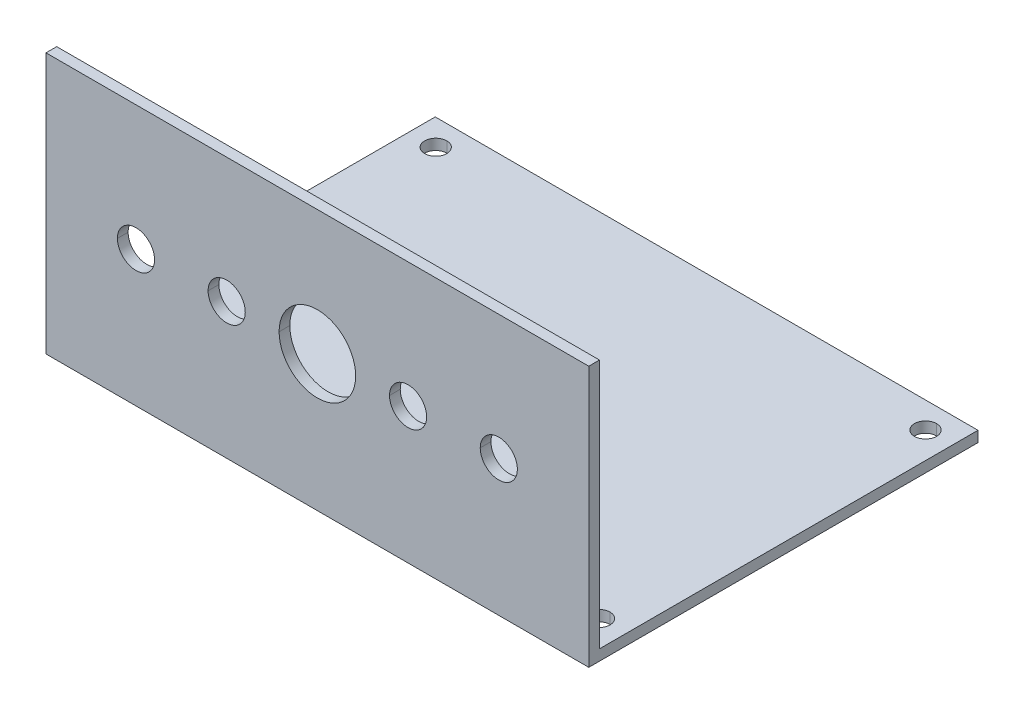
ISO-10303-21;
HEADER;
FILE_DESCRIPTION(('STEP AP214'),'2;1');
FILE_NAME('part.step','',(''),(''),'','','');
FILE_SCHEMA(('AUTOMOTIVE_DESIGN { 1 0 10303 214 1 1 1 1 }'));
ENDSEC;
DATA;
#1=APPLICATION_CONTEXT('core data for automotive mechanical design processes');
#2=APPLICATION_PROTOCOL_DEFINITION('international standard','automotive_design',2000,#1);
#3=PRODUCT_CONTEXT('',#1,'mechanical');
#4=PRODUCT('Part','Part','',(#3));
#5=PRODUCT_RELATED_PRODUCT_CATEGORY('part','',(#4));
#6=PRODUCT_DEFINITION_FORMATION('','',#4);
#7=PRODUCT_DEFINITION_CONTEXT('part definition',#1,'design');
#8=PRODUCT_DEFINITION('design','',#6,#7);
#9=PRODUCT_DEFINITION_SHAPE('','',#8);
#10=(LENGTH_UNIT() NAMED_UNIT(*) SI_UNIT(.MILLI.,.METRE.));
#11=(NAMED_UNIT(*) PLANE_ANGLE_UNIT() SI_UNIT($,.RADIAN.));
#12=(NAMED_UNIT(*) SI_UNIT($,.STERADIAN.) SOLID_ANGLE_UNIT());
#13=UNCERTAINTY_MEASURE_WITH_UNIT(LENGTH_MEASURE(1.E-05),#10,'distance_accuracy_value','');
#14=(GEOMETRIC_REPRESENTATION_CONTEXT(3) GLOBAL_UNCERTAINTY_ASSIGNED_CONTEXT((#13)) GLOBAL_UNIT_ASSIGNED_CONTEXT((#10,
#11,#12)) REPRESENTATION_CONTEXT('',''));
#15=CARTESIAN_POINT('',(0.,0.,0.));
#16=DIRECTION('',(0.,0.,1.));
#17=DIRECTION('',(1.,0.,0.));
#18=AXIS2_PLACEMENT_3D('',#15,#16,#17);
#19=CARTESIAN_POINT('',(-25.4,19.02,86.5));
#20=DIRECTION('',(0.,0.,-1.));
#21=DIRECTION('',(-1.,0.,0.));
#22=AXIS2_PLACEMENT_3D('',#19,#20,#21);
#23=CYLINDRICAL_SURFACE('',#22,2.600000007);
#24=DIRECTION('',(0.,0.,-1.));
#25=VECTOR('',#24,1.);
#26=CARTESIAN_POINT('',(-22.799999993,19.02,86.5));
#27=LINE('',#26,#25);
#28=CARTESIAN_POINT('',(-22.799999993,19.02,28.));
#29=VERTEX_POINT('',#28);
#30=CARTESIAN_POINT('',(-22.799999993,19.02,26.5));
#31=VERTEX_POINT('',#30);
#32=EDGE_CURVE('E313',#29,#31,#27,.T.);
#33=ORIENTED_EDGE('',*,*,#32,.F.);
#34=CARTESIAN_POINT('',(-25.4,19.02,28.));
#35=DIRECTION('',(0.,0.,1.));
#36=DIRECTION('',(1.,0.,0.));
#37=AXIS2_PLACEMENT_3D('',#34,#35,#36);
#38=CIRCLE('',#37,2.600000007);
#39=CARTESIAN_POINT('',(-28.000000007,19.02,28.));
#40=VERTEX_POINT('',#39);
#41=EDGE_CURVE('E296',#29,#40,#38,.T.);
#42=ORIENTED_EDGE('',*,*,#41,.T.);
#43=DIRECTION('',(0.,0.,-1.));
#44=VECTOR('',#43,1.);
#45=CARTESIAN_POINT('',(-28.000000007,19.02,86.5));
#46=LINE('',#45,#44);
#47=CARTESIAN_POINT('',(-28.000000007,19.02,26.5));
#48=VERTEX_POINT('',#47);
#49=EDGE_CURVE('E387',#40,#48,#46,.T.);
#50=ORIENTED_EDGE('',*,*,#49,.T.);
#51=CARTESIAN_POINT('',(-25.4,19.02,26.5));
#52=DIRECTION('',(0.,0.,-1.));
#53=DIRECTION('',(-1.,0.,0.));
#54=AXIS2_PLACEMENT_3D('',#51,#52,#53);
#55=CIRCLE('',#54,2.600000007);
#56=EDGE_CURVE('E386',#48,#31,#55,.T.);
#57=ORIENTED_EDGE('',*,*,#56,.T.);
#58=EDGE_LOOP('',(#33,#42,#50,#57));
#59=FACE_BOUND('',#58,.T.);
#60=ADVANCED_FACE('F16',(#59),#23,.F.);
#61=CARTESIAN_POINT('',(-12.7,19.02,86.5));
#62=DIRECTION('',(0.,0.,-1.));
#63=DIRECTION('',(-1.,0.,0.));
#64=AXIS2_PLACEMENT_3D('',#61,#62,#63);
#65=CYLINDRICAL_SURFACE('',#64,2.600000007);
#66=DIRECTION('',(0.,0.,-1.));
#67=VECTOR('',#66,1.);
#68=CARTESIAN_POINT('',(-10.099999993,19.02,86.5));
#69=LINE('',#68,#67);
#70=CARTESIAN_POINT('',(-10.099999993,19.02,28.));
#71=VERTEX_POINT('',#70);
#72=CARTESIAN_POINT('',(-10.099999993,19.02,26.5));
#73=VERTEX_POINT('',#72);
#74=EDGE_CURVE('E436',#71,#73,#69,.T.);
#75=ORIENTED_EDGE('',*,*,#74,.F.);
#76=CARTESIAN_POINT('',(-12.7,19.02,28.));
#77=DIRECTION('',(0.,0.,1.));
#78=DIRECTION('',(1.,0.,0.));
#79=AXIS2_PLACEMENT_3D('',#76,#77,#78);
#80=CIRCLE('',#79,2.600000007);
#81=CARTESIAN_POINT('',(-15.300000007,19.02,28.));
#82=VERTEX_POINT('',#81);
#83=EDGE_CURVE('E335',#71,#82,#80,.T.);
#84=ORIENTED_EDGE('',*,*,#83,.T.);
#85=DIRECTION('',(0.,0.,-1.));
#86=VECTOR('',#85,1.);
#87=CARTESIAN_POINT('',(-15.300000007,19.02,86.5));
#88=LINE('',#87,#86);
#89=CARTESIAN_POINT('',(-15.300000007,19.02,26.5));
#90=VERTEX_POINT('',#89);
#91=EDGE_CURVE('E435',#82,#90,#88,.T.);
#92=ORIENTED_EDGE('',*,*,#91,.T.);
#93=CARTESIAN_POINT('',(-12.7,19.02,26.5));
#94=DIRECTION('',(0.,0.,-1.));
#95=DIRECTION('',(-1.,0.,0.));
#96=AXIS2_PLACEMENT_3D('',#93,#94,#95);
#97=CIRCLE('',#96,2.600000007);
#98=EDGE_CURVE('E379',#90,#73,#97,.T.);
#99=ORIENTED_EDGE('',*,*,#98,.T.);
#100=EDGE_LOOP('',(#75,#84,#92,#99));
#101=FACE_BOUND('',#100,.T.);
#102=ADVANCED_FACE('F583',(#101),#65,.F.);
#103=CARTESIAN_POINT('',(25.4,19.02,86.5));
#104=DIRECTION('',(0.,0.,-1.));
#105=DIRECTION('',(-1.,0.,0.));
#106=AXIS2_PLACEMENT_3D('',#103,#104,#105);
#107=CYLINDRICAL_SURFACE('',#106,2.600000007);
#108=DIRECTION('',(0.,0.,-1.));
#109=VECTOR('',#108,1.);
#110=CARTESIAN_POINT('',(28.000000007,19.02,86.5));
#111=LINE('',#110,#109);
#112=CARTESIAN_POINT('',(28.000000007,19.02,28.));
#113=VERTEX_POINT('',#112);
#114=CARTESIAN_POINT('',(28.000000007,19.02,26.5));
#115=VERTEX_POINT('',#114);
#116=EDGE_CURVE('E325',#113,#115,#111,.T.);
#117=ORIENTED_EDGE('',*,*,#116,.F.);
#118=CARTESIAN_POINT('',(25.4,19.02,28.));
#119=DIRECTION('',(0.,0.,1.));
#120=DIRECTION('',(1.,0.,0.));
#121=AXIS2_PLACEMENT_3D('',#118,#119,#120);
#122=CIRCLE('',#121,2.600000007);
#123=CARTESIAN_POINT('',(22.799999993,19.02,28.));
#124=VERTEX_POINT('',#123);
#125=EDGE_CURVE('E293',#113,#124,#122,.T.);
#126=ORIENTED_EDGE('',*,*,#125,.T.);
#127=DIRECTION('',(0.,0.,-1.));
#128=VECTOR('',#127,1.);
#129=CARTESIAN_POINT('',(22.799999993,19.02,86.5));
#130=LINE('',#129,#128);
#131=CARTESIAN_POINT('',(22.799999993,19.02,26.5));
#132=VERTEX_POINT('',#131);
#133=EDGE_CURVE('E274',#124,#132,#130,.T.);
#134=ORIENTED_EDGE('',*,*,#133,.T.);
#135=CARTESIAN_POINT('',(25.4,19.02,26.5));
#136=DIRECTION('',(0.,0.,-1.));
#137=DIRECTION('',(-1.,0.,0.));
#138=AXIS2_PLACEMENT_3D('',#135,#136,#137);
#139=CIRCLE('',#138,2.600000007);
#140=EDGE_CURVE('E372',#132,#115,#139,.T.);
#141=ORIENTED_EDGE('',*,*,#140,.T.);
#142=EDGE_LOOP('',(#117,#126,#134,#141));
#143=FACE_BOUND('',#142,.T.);
#144=ADVANCED_FACE('F588',(#143),#107,.F.);
#145=CARTESIAN_POINT('',(12.7,19.02,86.5));
#146=DIRECTION('',(0.,0.,-1.));
#147=DIRECTION('',(-1.,0.,0.));
#148=AXIS2_PLACEMENT_3D('',#145,#146,#147);
#149=CYLINDRICAL_SURFACE('',#148,2.600000007);
#150=DIRECTION('',(0.,0.,-1.));
#151=VECTOR('',#150,1.);
#152=CARTESIAN_POINT('',(15.300000007,19.02,86.5));
#153=LINE('',#152,#151);
#154=CARTESIAN_POINT('',(15.300000007,19.02,28.));
#155=VERTEX_POINT('',#154);
#156=CARTESIAN_POINT('',(15.300000007,19.02,26.5));
#157=VERTEX_POINT('',#156);
#158=EDGE_CURVE('E273',#155,#157,#153,.T.);
#159=ORIENTED_EDGE('',*,*,#158,.F.);
#160=CARTESIAN_POINT('',(12.7,19.02,28.));
#161=DIRECTION('',(0.,0.,1.));
#162=DIRECTION('',(1.,0.,0.));
#163=AXIS2_PLACEMENT_3D('',#160,#161,#162);
#164=CIRCLE('',#163,2.600000007);
#165=CARTESIAN_POINT('',(10.099999993,19.02,28.));
#166=VERTEX_POINT('',#165);
#167=EDGE_CURVE('E289',#155,#166,#164,.T.);
#168=ORIENTED_EDGE('',*,*,#167,.T.);
#169=DIRECTION('',(0.,0.,-1.));
#170=VECTOR('',#169,1.);
#171=CARTESIAN_POINT('',(10.099999993,19.02,86.5));
#172=LINE('',#171,#170);
#173=CARTESIAN_POINT('',(10.099999993,19.02,26.5));
#174=VERTEX_POINT('',#173);
#175=EDGE_CURVE('E302',#166,#174,#172,.T.);
#176=ORIENTED_EDGE('',*,*,#175,.T.);
#177=CARTESIAN_POINT('',(12.7,19.02,26.5));
#178=DIRECTION('',(0.,0.,-1.));
#179=DIRECTION('',(-1.,0.,0.));
#180=AXIS2_PLACEMENT_3D('',#177,#178,#179);
#181=CIRCLE('',#180,2.600000007);
#182=EDGE_CURVE('E27',#174,#157,#181,.T.);
#183=ORIENTED_EDGE('',*,*,#182,.T.);
#184=EDGE_LOOP('',(#159,#168,#176,#183));
#185=FACE_BOUND('',#184,.T.);
#186=ADVANCED_FACE('F362',(#185),#149,.F.);
#187=CARTESIAN_POINT('',(0.,19.02,86.5));
#188=DIRECTION('',(0.,0.,-1.));
#189=DIRECTION('',(-1.,0.,0.));
#190=AXIS2_PLACEMENT_3D('',#187,#188,#189);
#191=CYLINDRICAL_SURFACE('',#190,5.36);
#192=DIRECTION('',(0.,0.,-1.));
#193=VECTOR('',#192,1.);
#194=CARTESIAN_POINT('',(5.36,19.02,86.5));
#195=LINE('',#194,#193);
#196=CARTESIAN_POINT('',(5.36,19.02,28.));
#197=VERTEX_POINT('',#196);
#198=CARTESIAN_POINT('',(5.36,19.02,26.5));
#199=VERTEX_POINT('',#198);
#200=EDGE_CURVE('E312',#197,#199,#195,.T.);
#201=ORIENTED_EDGE('',*,*,#200,.F.);
#202=CARTESIAN_POINT('',(0.,19.02,28.));
#203=DIRECTION('',(0.,0.,1.));
#204=DIRECTION('',(1.,0.,0.));
#205=AXIS2_PLACEMENT_3D('',#202,#203,#204);
#206=CIRCLE('',#205,5.36);
#207=CARTESIAN_POINT('',(-5.36,19.02,28.));
#208=VERTEX_POINT('',#207);
#209=EDGE_CURVE('E292',#197,#208,#206,.T.);
#210=ORIENTED_EDGE('',*,*,#209,.T.);
#211=DIRECTION('',(0.,0.,-1.));
#212=VECTOR('',#211,1.);
#213=CARTESIAN_POINT('',(-5.36,19.02,86.5));
#214=LINE('',#213,#212);
#215=CARTESIAN_POINT('',(-5.36,19.02,26.5));
#216=VERTEX_POINT('',#215);
#217=EDGE_CURVE('E407',#208,#216,#214,.T.);
#218=ORIENTED_EDGE('',*,*,#217,.T.);
#219=CARTESIAN_POINT('',(0.,19.02,26.5));
#220=DIRECTION('',(0.,0.,-1.));
#221=DIRECTION('',(-1.,0.,0.));
#222=AXIS2_PLACEMENT_3D('',#219,#220,#221);
#223=CIRCLE('',#222,5.36);
#224=EDGE_CURVE('E10',#216,#199,#223,.T.);
#225=ORIENTED_EDGE('',*,*,#224,.T.);
#226=EDGE_LOOP('',(#201,#210,#218,#225));
#227=FACE_BOUND('',#226,.T.);
#228=ADVANCED_FACE('F18',(#227),#191,.F.);
#229=CARTESIAN_POINT('',(0.,36.52,0.));
#230=DIRECTION('',(0.,-1.,0.));
#231=DIRECTION('',(0.,0.,-1.));
#232=AXIS2_PLACEMENT_3D('',#229,#230,#231);
#233=PLANE('',#232);
#234=DIRECTION('',(0.,0.,1.));
#235=VECTOR('',#234,1.);
#236=CARTESIAN_POINT('',(-38.,36.52,28.));
#237=LINE('',#236,#235);
#238=CARTESIAN_POINT('',(-38.,36.52,26.5));
#239=VERTEX_POINT('',#238);
#240=CARTESIAN_POINT('',(-38.,36.52,28.));
#241=VERTEX_POINT('',#240);
#242=EDGE_CURVE('E321',#239,#241,#237,.T.);
#243=ORIENTED_EDGE('',*,*,#242,.T.);
#244=DIRECTION('',(1.,0.,0.));
#245=VECTOR('',#244,1.);
#246=CARTESIAN_POINT('',(-38.,36.52,28.));
#247=LINE('',#246,#245);
#248=CARTESIAN_POINT('',(38.,36.52,28.));
#249=VERTEX_POINT('',#248);
#250=EDGE_CURVE('E42',#241,#249,#247,.T.);
#251=ORIENTED_EDGE('',*,*,#250,.T.);
#252=DIRECTION('',(0.,0.,-1.));
#253=VECTOR('',#252,1.);
#254=CARTESIAN_POINT('',(38.,36.52,28.));
#255=LINE('',#254,#253);
#256=CARTESIAN_POINT('',(38.,36.52,26.5));
#257=VERTEX_POINT('',#256);
#258=EDGE_CURVE('E397',#249,#257,#255,.T.);
#259=ORIENTED_EDGE('',*,*,#258,.T.);
#260=DIRECTION('',(-1.,0.,0.));
#261=VECTOR('',#260,1.);
#262=CARTESIAN_POINT('',(-38.,36.52,26.5));
#263=LINE('',#262,#261);
#264=EDGE_CURVE('E339',#257,#239,#263,.T.);
#265=ORIENTED_EDGE('',*,*,#264,.T.);
#266=EDGE_LOOP('',(#243,#251,#259,#265));
#267=FACE_BOUND('',#266,.T.);
#268=ADVANCED_FACE('F515',(#267),#233,.F.);
#269=CARTESIAN_POINT('',(-38.,36.52,26.5));
#270=DIRECTION('',(0.,0.,1.));
#271=DIRECTION('',(1.,0.,0.));
#272=AXIS2_PLACEMENT_3D('',#269,#270,#271);
#273=PLANE('',#272);
#274=ORIENTED_EDGE('',*,*,#224,.F.);
#275=CARTESIAN_POINT('',(0.,19.02,26.5));
#276=DIRECTION('',(0.,0.,-1.));
#277=DIRECTION('',(-1.,0.,0.));
#278=AXIS2_PLACEMENT_3D('',#275,#276,#277);
#279=CIRCLE('',#278,5.36);
#280=EDGE_CURVE('E412',#199,#216,#279,.T.);
#281=ORIENTED_EDGE('',*,*,#280,.F.);
#282=EDGE_LOOP('',(#274,#281));
#283=FACE_BOUND('',#282,.T.);
#284=ORIENTED_EDGE('',*,*,#182,.F.);
#285=CARTESIAN_POINT('',(12.7,19.02,26.5));
#286=DIRECTION('',(0.,0.,-1.));
#287=DIRECTION('',(-1.,0.,0.));
#288=AXIS2_PLACEMENT_3D('',#285,#286,#287);
#289=CIRCLE('',#288,2.600000007);
#290=EDGE_CURVE('E298',#157,#174,#289,.T.);
#291=ORIENTED_EDGE('',*,*,#290,.F.);
#292=EDGE_LOOP('',(#284,#291));
#293=FACE_BOUND('',#292,.T.);
#294=ORIENTED_EDGE('',*,*,#140,.F.);
#295=CARTESIAN_POINT('',(25.4,19.02,26.5));
#296=DIRECTION('',(0.,0.,-1.));
#297=DIRECTION('',(-1.,0.,0.));
#298=AXIS2_PLACEMENT_3D('',#295,#296,#297);
#299=CIRCLE('',#298,2.600000007);
#300=EDGE_CURVE('E329',#115,#132,#299,.T.);
#301=ORIENTED_EDGE('',*,*,#300,.F.);
#302=EDGE_LOOP('',(#294,#301));
#303=FACE_BOUND('',#302,.T.);
#304=ORIENTED_EDGE('',*,*,#98,.F.);
#305=CARTESIAN_POINT('',(-12.7,19.02,26.5));
#306=DIRECTION('',(0.,0.,-1.));
#307=DIRECTION('',(-1.,0.,0.));
#308=AXIS2_PLACEMENT_3D('',#305,#306,#307);
#309=CIRCLE('',#308,2.600000007);
#310=EDGE_CURVE('E431',#73,#90,#309,.T.);
#311=ORIENTED_EDGE('',*,*,#310,.F.);
#312=EDGE_LOOP('',(#304,#311));
#313=FACE_BOUND('',#312,.T.);
#314=ORIENTED_EDGE('',*,*,#56,.F.);
#315=CARTESIAN_POINT('',(-25.4,19.02,26.5));
#316=DIRECTION('',(0.,0.,-1.));
#317=DIRECTION('',(-1.,0.,0.));
#318=AXIS2_PLACEMENT_3D('',#315,#316,#317);
#319=CIRCLE('',#318,2.600000007);
#320=EDGE_CURVE('E317',#31,#48,#319,.T.);
#321=ORIENTED_EDGE('',*,*,#320,.F.);
#322=EDGE_LOOP('',(#314,#321));
#323=FACE_BOUND('',#322,.T.);
#324=DIRECTION('',(-1.,0.,0.));
#325=VECTOR('',#324,1.);
#326=CARTESIAN_POINT('',(-38.,1.5,26.5));
#327=LINE('',#326,#325);
#328=CARTESIAN_POINT('',(38.,1.5,26.5));
#329=VERTEX_POINT('',#328);
#330=CARTESIAN_POINT('',(-38.,1.5,26.5));
#331=VERTEX_POINT('',#330);
#332=EDGE_CURVE('E245',#329,#331,#327,.T.);
#333=ORIENTED_EDGE('',*,*,#332,.T.);
#334=DIRECTION('',(0.,-1.,0.));
#335=VECTOR('',#334,1.);
#336=CARTESIAN_POINT('',(-38.,36.52,26.5));
#337=LINE('',#336,#335);
#338=EDGE_CURVE('E288',#239,#331,#337,.T.);
#339=ORIENTED_EDGE('',*,*,#338,.F.);
#340=ORIENTED_EDGE('',*,*,#264,.F.);
#341=DIRECTION('',(0.,-1.,0.));
#342=VECTOR('',#341,1.);
#343=CARTESIAN_POINT('',(38.,36.52,26.5));
#344=LINE('',#343,#342);
#345=EDGE_CURVE('E332',#257,#329,#344,.T.);
#346=ORIENTED_EDGE('',*,*,#345,.T.);
#347=EDGE_LOOP('',(#333,#339,#340,#346));
#348=FACE_BOUND('',#347,.T.);
#349=ADVANCED_FACE('F369',(#283,#293,#303,#313,#323,#348),#273,.F.);
#350=CARTESIAN_POINT('',(0.,0.,28.));
#351=DIRECTION('',(0.,0.,1.));
#352=DIRECTION('',(1.,0.,0.));
#353=AXIS2_PLACEMENT_3D('',#350,#351,#352);
#354=PLANE('',#353);
#355=CARTESIAN_POINT('',(0.,19.02,28.));
#356=DIRECTION('',(0.,0.,1.));
#357=DIRECTION('',(1.,0.,0.));
#358=AXIS2_PLACEMENT_3D('',#355,#356,#357);
#359=CIRCLE('',#358,5.36);
#360=EDGE_CURVE('E308',#208,#197,#359,.T.);
#361=ORIENTED_EDGE('',*,*,#360,.F.);
#362=ORIENTED_EDGE('',*,*,#209,.F.);
#363=EDGE_LOOP('',(#361,#362));
#364=FACE_BOUND('',#363,.T.);
#365=CARTESIAN_POINT('',(12.7,19.02,28.));
#366=DIRECTION('',(0.,0.,1.));
#367=DIRECTION('',(1.,0.,0.));
#368=AXIS2_PLACEMENT_3D('',#365,#366,#367);
#369=CIRCLE('',#368,2.600000007);
#370=EDGE_CURVE('E269',#166,#155,#369,.T.);
#371=ORIENTED_EDGE('',*,*,#370,.F.);
#372=ORIENTED_EDGE('',*,*,#167,.F.);
#373=EDGE_LOOP('',(#371,#372));
#374=FACE_BOUND('',#373,.T.);
#375=CARTESIAN_POINT('',(25.4,19.02,28.));
#376=DIRECTION('',(0.,0.,1.));
#377=DIRECTION('',(1.,0.,0.));
#378=AXIS2_PLACEMENT_3D('',#375,#376,#377);
#379=CIRCLE('',#378,2.600000007);
#380=EDGE_CURVE('E262',#124,#113,#379,.T.);
#381=ORIENTED_EDGE('',*,*,#380,.F.);
#382=ORIENTED_EDGE('',*,*,#125,.F.);
#383=EDGE_LOOP('',(#381,#382));
#384=FACE_BOUND('',#383,.T.);
#385=CARTESIAN_POINT('',(-12.7,19.02,28.));
#386=DIRECTION('',(0.,0.,1.));
#387=DIRECTION('',(1.,0.,0.));
#388=AXIS2_PLACEMENT_3D('',#385,#386,#387);
#389=CIRCLE('',#388,2.600000007);
#390=EDGE_CURVE('E391',#82,#71,#389,.T.);
#391=ORIENTED_EDGE('',*,*,#390,.F.);
#392=ORIENTED_EDGE('',*,*,#83,.F.);
#393=EDGE_LOOP('',(#391,#392));
#394=FACE_BOUND('',#393,.T.);
#395=CARTESIAN_POINT('',(-25.4,19.02,28.));
#396=DIRECTION('',(0.,0.,1.));
#397=DIRECTION('',(1.,0.,0.));
#398=AXIS2_PLACEMENT_3D('',#395,#396,#397);
#399=CIRCLE('',#398,2.600000007);
#400=EDGE_CURVE('E318',#40,#29,#399,.T.);
#401=ORIENTED_EDGE('',*,*,#400,.F.);
#402=ORIENTED_EDGE('',*,*,#41,.F.);
#403=EDGE_LOOP('',(#401,#402));
#404=FACE_BOUND('',#403,.T.);
#405=DIRECTION('',(0.,-1.,0.));
#406=VECTOR('',#405,1.);
#407=CARTESIAN_POINT('',(-38.,1.5,28.));
#408=LINE('',#407,#406);
#409=CARTESIAN_POINT('',(-38.,0.,28.));
#410=VERTEX_POINT('',#409);
#411=EDGE_CURVE('E395',#241,#410,#408,.T.);
#412=ORIENTED_EDGE('',*,*,#411,.T.);
#413=DIRECTION('',(1.,0.,0.));
#414=VECTOR('',#413,1.);
#415=CARTESIAN_POINT('',(-38.,0.,28.));
#416=LINE('',#415,#414);
#417=CARTESIAN_POINT('',(38.,0.,28.));
#418=VERTEX_POINT('',#417);
#419=EDGE_CURVE('E350',#410,#418,#416,.T.);
#420=ORIENTED_EDGE('',*,*,#419,.T.);
#421=DIRECTION('',(0.,-1.,0.));
#422=VECTOR('',#421,1.);
#423=CARTESIAN_POINT('',(38.,1.5,28.));
#424=LINE('',#423,#422);
#425=EDGE_CURVE('E297',#249,#418,#424,.T.);
#426=ORIENTED_EDGE('',*,*,#425,.F.);
#427=ORIENTED_EDGE('',*,*,#250,.F.);
#428=EDGE_LOOP('',(#412,#420,#426,#427));
#429=FACE_BOUND('',#428,.T.);
#430=ADVANCED_FACE('F488',(#364,#374,#384,#394,#404,#429),#354,.T.);
#431=CARTESIAN_POINT('',(34.29,1.5,-22.86));
#432=DIRECTION('',(0.,-1.,0.));
#433=DIRECTION('',(0.,0.,-1.));
#434=AXIS2_PLACEMENT_3D('',#431,#432,#433);
#435=CYLINDRICAL_SURFACE('',#434,1.55);
#436=DIRECTION('',(0.,-1.,0.));
#437=VECTOR('',#436,1.);
#438=CARTESIAN_POINT('',(34.29,1.5,-21.31));
#439=LINE('',#438,#437);
#440=CARTESIAN_POINT('',(34.29,1.5,-21.31));
#441=VERTEX_POINT('',#440);
#442=CARTESIAN_POINT('',(34.29,0.,-21.31));
#443=VERTEX_POINT('',#442);
#444=EDGE_CURVE('E419',#441,#443,#439,.T.);
#445=ORIENTED_EDGE('',*,*,#444,.F.);
#446=CARTESIAN_POINT('',(34.29,1.5,-22.86));
#447=DIRECTION('',(0.,1.,0.));
#448=DIRECTION('',(0.,0.,1.));
#449=AXIS2_PLACEMENT_3D('',#446,#447,#448);
#450=CIRCLE('',#449,1.55);
#451=CARTESIAN_POINT('',(34.29,1.5,-24.41));
#452=VERTEX_POINT('',#451);
#453=EDGE_CURVE('E20',#441,#452,#450,.T.);
#454=ORIENTED_EDGE('',*,*,#453,.T.);
#455=DIRECTION('',(0.,-1.,0.));
#456=VECTOR('',#455,1.);
#457=CARTESIAN_POINT('',(34.29,1.5,-24.41));
#458=LINE('',#457,#456);
#459=CARTESIAN_POINT('',(34.29,0.,-24.41));
#460=VERTEX_POINT('',#459);
#461=EDGE_CURVE('E527',#452,#460,#458,.T.);
#462=ORIENTED_EDGE('',*,*,#461,.T.);
#463=CARTESIAN_POINT('',(34.29,0.,-22.86));
#464=DIRECTION('',(0.,1.,0.));
#465=DIRECTION('',(0.,0.,1.));
#466=AXIS2_PLACEMENT_3D('',#463,#464,#465);
#467=CIRCLE('',#466,1.55);
#468=EDGE_CURVE('E392',#443,#460,#467,.T.);
#469=ORIENTED_EDGE('',*,*,#468,.F.);
#470=EDGE_LOOP('',(#445,#454,#462,#469));
#471=FACE_BOUND('',#470,.T.);
#472=ADVANCED_FACE('F491',(#471),#435,.F.);
#473=CARTESIAN_POINT('',(34.29,1.5,22.86));
#474=DIRECTION('',(0.,-1.,0.));
#475=DIRECTION('',(0.,0.,-1.));
#476=AXIS2_PLACEMENT_3D('',#473,#474,#475);
#477=CYLINDRICAL_SURFACE('',#476,1.55);
#478=DIRECTION('',(0.,-1.,0.));
#479=VECTOR('',#478,1.);
#480=CARTESIAN_POINT('',(34.29,1.5,24.41));
#481=LINE('',#480,#479);
#482=CARTESIAN_POINT('',(34.29,1.5,24.41));
#483=VERTEX_POINT('',#482);
#484=CARTESIAN_POINT('',(34.29,0.,24.41));
#485=VERTEX_POINT('',#484);
#486=EDGE_CURVE('E278',#483,#485,#481,.T.);
#487=ORIENTED_EDGE('',*,*,#486,.F.);
#488=CARTESIAN_POINT('',(34.29,1.5,22.86));
#489=DIRECTION('',(0.,1.,0.));
#490=DIRECTION('',(0.,0.,1.));
#491=AXIS2_PLACEMENT_3D('',#488,#489,#490);
#492=CIRCLE('',#491,1.55);
#493=CARTESIAN_POINT('',(34.29,1.5,21.31));
#494=VERTEX_POINT('',#493);
#495=EDGE_CURVE('E237',#483,#494,#492,.T.);
#496=ORIENTED_EDGE('',*,*,#495,.T.);
#497=DIRECTION('',(0.,-1.,0.));
#498=VECTOR('',#497,1.);
#499=CARTESIAN_POINT('',(34.29,1.5,21.31));
#500=LINE('',#499,#498);
#501=CARTESIAN_POINT('',(34.29,0.,21.31));
#502=VERTEX_POINT('',#501);
#503=EDGE_CURVE('E344',#494,#502,#500,.T.);
#504=ORIENTED_EDGE('',*,*,#503,.T.);
#505=CARTESIAN_POINT('',(34.29,0.,22.86));
#506=DIRECTION('',(0.,1.,0.));
#507=DIRECTION('',(0.,0.,1.));
#508=AXIS2_PLACEMENT_3D('',#505,#506,#507);
#509=CIRCLE('',#508,1.55);
#510=EDGE_CURVE('E396',#485,#502,#509,.T.);
#511=ORIENTED_EDGE('',*,*,#510,.F.);
#512=EDGE_LOOP('',(#487,#496,#504,#511));
#513=FACE_BOUND('',#512,.T.);
#514=ADVANCED_FACE('F919',(#513),#477,.F.);
#515=CARTESIAN_POINT('',(-34.29,1.5,22.86));
#516=DIRECTION('',(0.,-1.,0.));
#517=DIRECTION('',(0.,0.,-1.));
#518=AXIS2_PLACEMENT_3D('',#515,#516,#517);
#519=CYLINDRICAL_SURFACE('',#518,1.55);
#520=DIRECTION('',(0.,-1.,0.));
#521=VECTOR('',#520,1.);
#522=CARTESIAN_POINT('',(-34.29,1.5,24.41));
#523=LINE('',#522,#521);
#524=CARTESIAN_POINT('',(-34.29,1.5,24.41));
#525=VERTEX_POINT('',#524);
#526=CARTESIAN_POINT('',(-34.29,0.,24.41));
#527=VERTEX_POINT('',#526);
#528=EDGE_CURVE('E268',#525,#527,#523,.T.);
#529=ORIENTED_EDGE('',*,*,#528,.F.);
#530=CARTESIAN_POINT('',(-34.29,1.5,22.86));
#531=DIRECTION('',(0.,1.,0.));
#532=DIRECTION('',(0.,0.,1.));
#533=AXIS2_PLACEMENT_3D('',#530,#531,#532);
#534=CIRCLE('',#533,1.55);
#535=CARTESIAN_POINT('',(-34.29,1.5,21.31));
#536=VERTEX_POINT('',#535);
#537=EDGE_CURVE('E236',#525,#536,#534,.T.);
#538=ORIENTED_EDGE('',*,*,#537,.T.);
#539=DIRECTION('',(0.,-1.,0.));
#540=VECTOR('',#539,1.);
#541=CARTESIAN_POINT('',(-34.29,1.5,21.31));
#542=LINE('',#541,#540);
#543=CARTESIAN_POINT('',(-34.29,0.,21.31));
#544=VERTEX_POINT('',#543);
#545=EDGE_CURVE('E250',#536,#544,#542,.T.);
#546=ORIENTED_EDGE('',*,*,#545,.T.);
#547=CARTESIAN_POINT('',(-34.29,0.,22.86));
#548=DIRECTION('',(0.,1.,0.));
#549=DIRECTION('',(0.,0.,1.));
#550=AXIS2_PLACEMENT_3D('',#547,#548,#549);
#551=CIRCLE('',#550,1.55);
#552=EDGE_CURVE('E349',#527,#544,#551,.T.);
#553=ORIENTED_EDGE('',*,*,#552,.F.);
#554=EDGE_LOOP('',(#529,#538,#546,#553));
#555=FACE_BOUND('',#554,.T.);
#556=ADVANCED_FACE('F568',(#555),#519,.F.);
#557=CARTESIAN_POINT('',(-34.29,1.5,-22.86));
#558=DIRECTION('',(0.,-1.,0.));
#559=DIRECTION('',(0.,0.,-1.));
#560=AXIS2_PLACEMENT_3D('',#557,#558,#559);
#561=CYLINDRICAL_SURFACE('',#560,1.55);
#562=DIRECTION('',(0.,-1.,0.));
#563=VECTOR('',#562,1.);
#564=CARTESIAN_POINT('',(-34.29,1.5,-21.31));
#565=LINE('',#564,#563);
#566=CARTESIAN_POINT('',(-34.29,1.5,-21.31));
#567=VERTEX_POINT('',#566);
#568=CARTESIAN_POINT('',(-34.29,0.,-21.31));
#569=VERTEX_POINT('',#568);
#570=EDGE_CURVE('E231',#567,#569,#565,.T.);
#571=ORIENTED_EDGE('',*,*,#570,.F.);
#572=CARTESIAN_POINT('',(-34.29,1.5,-22.86));
#573=DIRECTION('',(0.,1.,0.));
#574=DIRECTION('',(0.,0.,1.));
#575=AXIS2_PLACEMENT_3D('',#572,#573,#574);
#576=CIRCLE('',#575,1.55);
#577=CARTESIAN_POINT('',(-34.29,1.5,-24.41));
#578=VERTEX_POINT('',#577);
#579=EDGE_CURVE('E225',#567,#578,#576,.T.);
#580=ORIENTED_EDGE('',*,*,#579,.T.);
#581=DIRECTION('',(0.,-1.,0.));
#582=VECTOR('',#581,1.);
#583=CARTESIAN_POINT('',(-34.29,1.5,-24.41));
#584=LINE('',#583,#582);
#585=CARTESIAN_POINT('',(-34.29,0.,-24.41));
#586=VERTEX_POINT('',#585);
#587=EDGE_CURVE('E228',#578,#586,#584,.T.);
#588=ORIENTED_EDGE('',*,*,#587,.T.);
#589=CARTESIAN_POINT('',(-34.29,0.,-22.86));
#590=DIRECTION('',(0.,1.,0.));
#591=DIRECTION('',(0.,0.,1.));
#592=AXIS2_PLACEMENT_3D('',#589,#590,#591);
#593=CIRCLE('',#592,1.55);
#594=EDGE_CURVE('E347',#569,#586,#593,.T.);
#595=ORIENTED_EDGE('',*,*,#594,.F.);
#596=EDGE_LOOP('',(#571,#580,#588,#595));
#597=FACE_BOUND('',#596,.T.);
#598=ADVANCED_FACE('F227',(#597),#561,.F.);
#599=CARTESIAN_POINT('',(38.,1.5,-26.5));
#600=DIRECTION('',(0.,0.,1.));
#601=DIRECTION('',(1.,0.,0.));
#602=AXIS2_PLACEMENT_3D('',#599,#600,#601);
#603=PLANE('',#602);
#604=DIRECTION('',(-1.,0.,0.));
#605=VECTOR('',#604,1.);
#606=CARTESIAN_POINT('',(38.,0.,-26.5));
#607=LINE('',#606,#605);
#608=CARTESIAN_POINT('',(38.,0.,-26.5));
#609=VERTEX_POINT('',#608);
#610=CARTESIAN_POINT('',(-38.,0.,-26.5));
#611=VERTEX_POINT('',#610);
#612=EDGE_CURVE('E413',#609,#611,#607,.T.);
#613=ORIENTED_EDGE('',*,*,#612,.T.);
#614=DIRECTION('',(0.,-1.,0.));
#615=VECTOR('',#614,1.);
#616=CARTESIAN_POINT('',(-38.,1.5,-26.5));
#617=LINE('',#616,#615);
#618=CARTESIAN_POINT('',(-38.,1.5,-26.5));
#619=VERTEX_POINT('',#618);
#620=EDGE_CURVE('E284',#619,#611,#617,.T.);
#621=ORIENTED_EDGE('',*,*,#620,.F.);
#622=DIRECTION('',(-1.,0.,0.));
#623=VECTOR('',#622,1.);
#624=CARTESIAN_POINT('',(38.,1.5,-26.5));
#625=LINE('',#624,#623);
#626=CARTESIAN_POINT('',(38.,1.5,-26.5));
#627=VERTEX_POINT('',#626);
#628=EDGE_CURVE('E307',#627,#619,#625,.T.);
#629=ORIENTED_EDGE('',*,*,#628,.F.);
#630=DIRECTION('',(0.,-1.,0.));
#631=VECTOR('',#630,1.);
#632=CARTESIAN_POINT('',(38.,1.5,-26.5));
#633=LINE('',#632,#631);
#634=EDGE_CURVE('E287',#627,#609,#633,.T.);
#635=ORIENTED_EDGE('',*,*,#634,.T.);
#636=EDGE_LOOP('',(#613,#621,#629,#635));
#637=FACE_BOUND('',#636,.T.);
#638=ADVANCED_FACE('F508',(#637),#603,.F.);
#639=CARTESIAN_POINT('',(38.,1.5,26.5));
#640=DIRECTION('',(-1.,0.,0.));
#641=DIRECTION('',(0.,0.,1.));
#642=AXIS2_PLACEMENT_3D('',#639,#640,#641);
#643=PLANE('',#642);
#644=DIRECTION('',(0.,0.,-1.));
#645=VECTOR('',#644,1.);
#646=CARTESIAN_POINT('',(38.,0.,26.5));
#647=LINE('',#646,#645);
#648=EDGE_CURVE('E417',#418,#609,#647,.T.);
#649=ORIENTED_EDGE('',*,*,#648,.T.);
#650=ORIENTED_EDGE('',*,*,#634,.F.);
#651=DIRECTION('',(0.,0.,-1.));
#652=VECTOR('',#651,1.);
#653=CARTESIAN_POINT('',(38.,1.5,26.5));
#654=LINE('',#653,#652);
#655=EDGE_CURVE('E303',#329,#627,#654,.T.);
#656=ORIENTED_EDGE('',*,*,#655,.F.);
#657=ORIENTED_EDGE('',*,*,#345,.F.);
#658=ORIENTED_EDGE('',*,*,#258,.F.);
#659=ORIENTED_EDGE('',*,*,#425,.T.);
#660=EDGE_LOOP('',(#649,#650,#656,#657,#658,#659));
#661=FACE_BOUND('',#660,.T.);
#662=ADVANCED_FACE('F512',(#661),#643,.F.);
#663=CARTESIAN_POINT('',(-38.,1.5,26.5));
#664=DIRECTION('',(1.,0.,0.));
#665=DIRECTION('',(0.,1.,0.));
#666=AXIS2_PLACEMENT_3D('',#663,#664,#665);
#667=PLANE('',#666);
#668=DIRECTION('',(0.,0.,1.));
#669=VECTOR('',#668,1.);
#670=CARTESIAN_POINT('',(-38.,0.,26.5));
#671=LINE('',#670,#669);
#672=EDGE_CURVE('E418',#611,#410,#671,.T.);
#673=ORIENTED_EDGE('',*,*,#672,.T.);
#674=ORIENTED_EDGE('',*,*,#411,.F.);
#675=ORIENTED_EDGE('',*,*,#242,.F.);
#676=ORIENTED_EDGE('',*,*,#338,.T.);
#677=DIRECTION('',(0.,0.,1.));
#678=VECTOR('',#677,1.);
#679=CARTESIAN_POINT('',(-38.,1.5,26.5));
#680=LINE('',#679,#678);
#681=EDGE_CURVE('E277',#619,#331,#680,.T.);
#682=ORIENTED_EDGE('',*,*,#681,.F.);
#683=ORIENTED_EDGE('',*,*,#620,.T.);
#684=EDGE_LOOP('',(#673,#674,#675,#676,#682,#683));
#685=FACE_BOUND('',#684,.T.);
#686=ADVANCED_FACE('F503',(#685),#667,.F.);
#687=CARTESIAN_POINT('',(0.,0.,0.));
#688=DIRECTION('',(0.,1.,0.));
#689=DIRECTION('',(1.,0.,0.));
#690=AXIS2_PLACEMENT_3D('',#687,#688,#689);
#691=PLANE('',#690);
#692=CARTESIAN_POINT('',(34.29,0.,-22.86));
#693=DIRECTION('',(0.,1.,0.));
#694=DIRECTION('',(0.,0.,1.));
#695=AXIS2_PLACEMENT_3D('',#692,#693,#694);
#696=CIRCLE('',#695,1.55);
#697=EDGE_CURVE('E383',#460,#443,#696,.T.);
#698=ORIENTED_EDGE('',*,*,#697,.T.);
#699=ORIENTED_EDGE('',*,*,#468,.T.);
#700=EDGE_LOOP('',(#698,#699));
#701=FACE_BOUND('',#700,.T.);
#702=CARTESIAN_POINT('',(34.29,0.,22.86));
#703=DIRECTION('',(0.,1.,0.));
#704=DIRECTION('',(0.,0.,1.));
#705=AXIS2_PLACEMENT_3D('',#702,#703,#704);
#706=CIRCLE('',#705,1.55);
#707=EDGE_CURVE('E282',#502,#485,#706,.T.);
#708=ORIENTED_EDGE('',*,*,#707,.T.);
#709=ORIENTED_EDGE('',*,*,#510,.T.);
#710=EDGE_LOOP('',(#708,#709));
#711=FACE_BOUND('',#710,.T.);
#712=CARTESIAN_POINT('',(-34.29,0.,22.86));
#713=DIRECTION('',(0.,1.,0.));
#714=DIRECTION('',(0.,0.,1.));
#715=AXIS2_PLACEMENT_3D('',#712,#713,#714);
#716=CIRCLE('',#715,1.55);
#717=EDGE_CURVE('E259',#544,#527,#716,.T.);
#718=ORIENTED_EDGE('',*,*,#717,.T.);
#719=ORIENTED_EDGE('',*,*,#552,.T.);
#720=EDGE_LOOP('',(#718,#719));
#721=FACE_BOUND('',#720,.T.);
#722=CARTESIAN_POINT('',(-34.29,0.,-22.86));
#723=DIRECTION('',(0.,1.,0.));
#724=DIRECTION('',(0.,0.,1.));
#725=AXIS2_PLACEMENT_3D('',#722,#723,#724);
#726=CIRCLE('',#725,1.55);
#727=EDGE_CURVE('E243',#586,#569,#726,.T.);
#728=ORIENTED_EDGE('',*,*,#727,.T.);
#729=ORIENTED_EDGE('',*,*,#594,.T.);
#730=EDGE_LOOP('',(#728,#729));
#731=FACE_BOUND('',#730,.T.);
#732=ORIENTED_EDGE('',*,*,#672,.F.);
#733=ORIENTED_EDGE('',*,*,#612,.F.);
#734=ORIENTED_EDGE('',*,*,#648,.F.);
#735=ORIENTED_EDGE('',*,*,#419,.F.);
#736=EDGE_LOOP('',(#732,#733,#734,#735));
#737=FACE_BOUND('',#736,.T.);
#738=ADVANCED_FACE('F501',(#701,#711,#721,#731,#737),#691,.F.);
#739=CARTESIAN_POINT('',(0.,1.5,0.));
#740=DIRECTION('',(0.,1.,0.));
#741=DIRECTION('',(1.,0.,0.));
#742=AXIS2_PLACEMENT_3D('',#739,#740,#741);
#743=PLANE('',#742);
#744=CARTESIAN_POINT('',(34.29,1.5,-22.86));
#745=DIRECTION('',(0.,1.,0.));
#746=DIRECTION('',(0.,0.,1.));
#747=AXIS2_PLACEMENT_3D('',#744,#745,#746);
#748=CIRCLE('',#747,1.55);
#749=EDGE_CURVE('E411',#452,#441,#748,.T.);
#750=ORIENTED_EDGE('',*,*,#749,.F.);
#751=ORIENTED_EDGE('',*,*,#453,.F.);
#752=EDGE_LOOP('',(#750,#751));
#753=FACE_BOUND('',#752,.T.);
#754=CARTESIAN_POINT('',(-34.29,1.5,22.86));
#755=DIRECTION('',(0.,1.,0.));
#756=DIRECTION('',(0.,0.,1.));
#757=AXIS2_PLACEMENT_3D('',#754,#755,#756);
#758=CIRCLE('',#757,1.55);
#759=EDGE_CURVE('E340',#536,#525,#758,.T.);
#760=ORIENTED_EDGE('',*,*,#759,.F.);
#761=ORIENTED_EDGE('',*,*,#537,.F.);
#762=EDGE_LOOP('',(#760,#761));
#763=FACE_BOUND('',#762,.T.);
#764=CARTESIAN_POINT('',(-34.29,1.5,-22.86));
#765=DIRECTION('',(0.,1.,0.));
#766=DIRECTION('',(0.,0.,1.));
#767=AXIS2_PLACEMENT_3D('',#764,#765,#766);
#768=CIRCLE('',#767,1.55);
#769=EDGE_CURVE('E241',#578,#567,#768,.T.);
#770=ORIENTED_EDGE('',*,*,#769,.F.);
#771=ORIENTED_EDGE('',*,*,#579,.F.);
#772=EDGE_LOOP('',(#770,#771));
#773=FACE_BOUND('',#772,.T.);
#774=CARTESIAN_POINT('',(34.29,1.5,22.86));
#775=DIRECTION('',(0.,1.,0.));
#776=DIRECTION('',(0.,0.,1.));
#777=AXIS2_PLACEMENT_3D('',#774,#775,#776);
#778=CIRCLE('',#777,1.55);
#779=EDGE_CURVE('E283',#494,#483,#778,.T.);
#780=ORIENTED_EDGE('',*,*,#779,.F.);
#781=ORIENTED_EDGE('',*,*,#495,.F.);
#782=EDGE_LOOP('',(#780,#781));
#783=FACE_BOUND('',#782,.T.);
#784=ORIENTED_EDGE('',*,*,#332,.F.);
#785=ORIENTED_EDGE('',*,*,#655,.T.);
#786=ORIENTED_EDGE('',*,*,#628,.T.);
#787=ORIENTED_EDGE('',*,*,#681,.T.);
#788=EDGE_LOOP('',(#784,#785,#786,#787));
#789=FACE_BOUND('',#788,.T.);
#790=ADVANCED_FACE('F247',(#753,#763,#773,#783,#789),#743,.T.);
#791=CARTESIAN_POINT('',(-34.29,1.5,-22.86));
#792=DIRECTION('',(0.,-1.,0.));
#793=DIRECTION('',(0.,0.,-1.));
#794=AXIS2_PLACEMENT_3D('',#791,#792,#793);
#795=CYLINDRICAL_SURFACE('',#794,1.55);
#796=ORIENTED_EDGE('',*,*,#769,.T.);
#797=ORIENTED_EDGE('',*,*,#570,.T.);
#798=ORIENTED_EDGE('',*,*,#727,.F.);
#799=ORIENTED_EDGE('',*,*,#587,.F.);
#800=EDGE_LOOP('',(#796,#797,#798,#799));
#801=FACE_BOUND('',#800,.T.);
#802=ADVANCED_FACE('F240',(#801),#795,.F.);
#803=CARTESIAN_POINT('',(-34.29,1.5,22.86));
#804=DIRECTION('',(0.,-1.,0.));
#805=DIRECTION('',(0.,0.,-1.));
#806=AXIS2_PLACEMENT_3D('',#803,#804,#805);
#807=CYLINDRICAL_SURFACE('',#806,1.55);
#808=ORIENTED_EDGE('',*,*,#759,.T.);
#809=ORIENTED_EDGE('',*,*,#528,.T.);
#810=ORIENTED_EDGE('',*,*,#717,.F.);
#811=ORIENTED_EDGE('',*,*,#545,.F.);
#812=EDGE_LOOP('',(#808,#809,#810,#811));
#813=FACE_BOUND('',#812,.T.);
#814=ADVANCED_FACE('F566',(#813),#807,.F.);
#815=CARTESIAN_POINT('',(34.29,1.5,22.86));
#816=DIRECTION('',(0.,-1.,0.));
#817=DIRECTION('',(0.,0.,-1.));
#818=AXIS2_PLACEMENT_3D('',#815,#816,#817);
#819=CYLINDRICAL_SURFACE('',#818,1.55);
#820=ORIENTED_EDGE('',*,*,#779,.T.);
#821=ORIENTED_EDGE('',*,*,#486,.T.);
#822=ORIENTED_EDGE('',*,*,#707,.F.);
#823=ORIENTED_EDGE('',*,*,#503,.F.);
#824=EDGE_LOOP('',(#820,#821,#822,#823));
#825=FACE_BOUND('',#824,.T.);
#826=ADVANCED_FACE('F593',(#825),#819,.F.);
#827=CARTESIAN_POINT('',(34.29,1.5,-22.86));
#828=DIRECTION('',(0.,-1.,0.));
#829=DIRECTION('',(0.,0.,-1.));
#830=AXIS2_PLACEMENT_3D('',#827,#828,#829);
#831=CYLINDRICAL_SURFACE('',#830,1.55);
#832=ORIENTED_EDGE('',*,*,#749,.T.);
#833=ORIENTED_EDGE('',*,*,#444,.T.);
#834=ORIENTED_EDGE('',*,*,#697,.F.);
#835=ORIENTED_EDGE('',*,*,#461,.F.);
#836=EDGE_LOOP('',(#832,#833,#834,#835));
#837=FACE_BOUND('',#836,.T.);
#838=ADVANCED_FACE('F560',(#837),#831,.F.);
#839=CARTESIAN_POINT('',(0.,19.02,86.5));
#840=DIRECTION('',(0.,0.,-1.));
#841=DIRECTION('',(-1.,0.,0.));
#842=AXIS2_PLACEMENT_3D('',#839,#840,#841);
#843=CYLINDRICAL_SURFACE('',#842,5.36);
#844=ORIENTED_EDGE('',*,*,#360,.T.);
#845=ORIENTED_EDGE('',*,*,#200,.T.);
#846=ORIENTED_EDGE('',*,*,#280,.T.);
#847=ORIENTED_EDGE('',*,*,#217,.F.);
#848=EDGE_LOOP('',(#844,#845,#846,#847));
#849=FACE_BOUND('',#848,.T.);
#850=ADVANCED_FACE('F600',(#849),#843,.F.);
#851=CARTESIAN_POINT('',(12.7,19.02,86.5));
#852=DIRECTION('',(0.,0.,-1.));
#853=DIRECTION('',(-1.,0.,0.));
#854=AXIS2_PLACEMENT_3D('',#851,#852,#853);
#855=CYLINDRICAL_SURFACE('',#854,2.600000007);
#856=ORIENTED_EDGE('',*,*,#370,.T.);
#857=ORIENTED_EDGE('',*,*,#158,.T.);
#858=ORIENTED_EDGE('',*,*,#290,.T.);
#859=ORIENTED_EDGE('',*,*,#175,.F.);
#860=EDGE_LOOP('',(#856,#857,#858,#859));
#861=FACE_BOUND('',#860,.T.);
#862=ADVANCED_FACE('F367',(#861),#855,.F.);
#863=CARTESIAN_POINT('',(25.4,19.02,86.5));
#864=DIRECTION('',(0.,0.,-1.));
#865=DIRECTION('',(-1.,0.,0.));
#866=AXIS2_PLACEMENT_3D('',#863,#864,#865);
#867=CYLINDRICAL_SURFACE('',#866,2.600000007);
#868=ORIENTED_EDGE('',*,*,#380,.T.);
#869=ORIENTED_EDGE('',*,*,#116,.T.);
#870=ORIENTED_EDGE('',*,*,#300,.T.);
#871=ORIENTED_EDGE('',*,*,#133,.F.);
#872=EDGE_LOOP('',(#868,#869,#870,#871));
#873=FACE_BOUND('',#872,.T.);
#874=ADVANCED_FACE('F820',(#873),#867,.F.);
#875=CARTESIAN_POINT('',(-12.7,19.02,86.5));
#876=DIRECTION('',(0.,0.,-1.));
#877=DIRECTION('',(-1.,0.,0.));
#878=AXIS2_PLACEMENT_3D('',#875,#876,#877);
#879=CYLINDRICAL_SURFACE('',#878,2.600000007);
#880=ORIENTED_EDGE('',*,*,#390,.T.);
#881=ORIENTED_EDGE('',*,*,#74,.T.);
#882=ORIENTED_EDGE('',*,*,#310,.T.);
#883=ORIENTED_EDGE('',*,*,#91,.F.);
#884=EDGE_LOOP('',(#880,#881,#882,#883));
#885=FACE_BOUND('',#884,.T.);
#886=ADVANCED_FACE('F816',(#885),#879,.F.);
#887=CARTESIAN_POINT('',(-25.4,19.02,86.5));
#888=DIRECTION('',(0.,0.,-1.));
#889=DIRECTION('',(-1.,0.,0.));
#890=AXIS2_PLACEMENT_3D('',#887,#888,#889);
#891=CYLINDRICAL_SURFACE('',#890,2.600000007);
#892=ORIENTED_EDGE('',*,*,#400,.T.);
#893=ORIENTED_EDGE('',*,*,#32,.T.);
#894=ORIENTED_EDGE('',*,*,#320,.T.);
#895=ORIENTED_EDGE('',*,*,#49,.F.);
#896=EDGE_LOOP('',(#892,#893,#894,#895));
#897=FACE_BOUND('',#896,.T.);
#898=ADVANCED_FACE('F485',(#897),#891,.F.);
#899=CLOSED_SHELL('',(#60,#102,#144,#186,#228,#268,#349,#430,#472,#514,#556,#598,#638,#662,#686,
#738,#790,#802,#814,#826,#838,#850,#862,#874,#886,#898));
#900=MANIFOLD_SOLID_BREP('B1',#899);
#901=ADVANCED_BREP_SHAPE_REPRESENTATION('',(#18,#900),#14);
#902=SHAPE_DEFINITION_REPRESENTATION(#9,#901);
ENDSEC;
END-ISO-10303-21;
